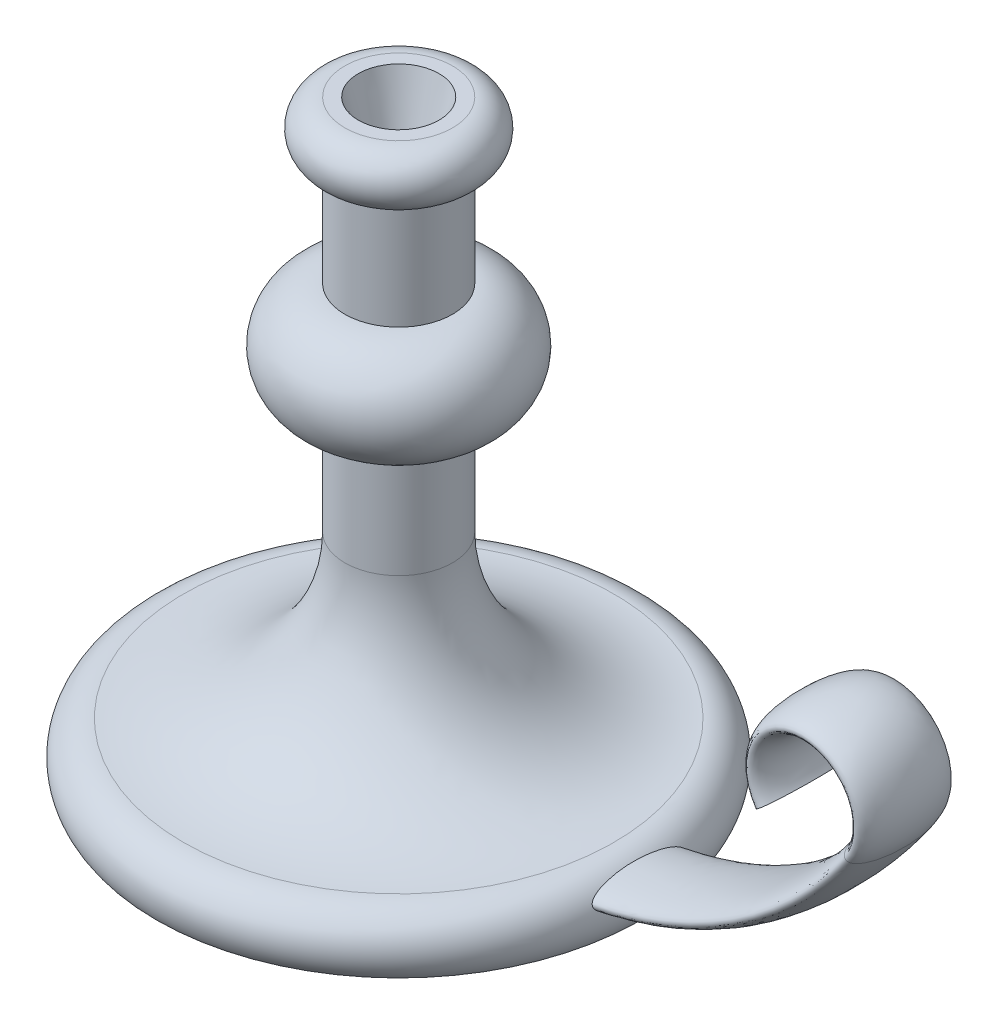
ISO-10303-21;
HEADER;
FILE_DESCRIPTION(('STEP AP214'),'2;1');
FILE_NAME('part.step','',(''),(''),'','','');
FILE_SCHEMA(('AUTOMOTIVE_DESIGN { 1 0 10303 214 1 1 1 1 }'));
ENDSEC;
DATA;
#1=APPLICATION_CONTEXT('core data for automotive mechanical design processes');
#2=APPLICATION_PROTOCOL_DEFINITION('international standard','automotive_design',2000,#1);
#3=PRODUCT_CONTEXT('',#1,'mechanical');
#4=PRODUCT('Part','Part','',(#3));
#5=PRODUCT_RELATED_PRODUCT_CATEGORY('part','',(#4));
#6=PRODUCT_DEFINITION_FORMATION('','',#4);
#7=PRODUCT_DEFINITION_CONTEXT('part definition',#1,'design');
#8=PRODUCT_DEFINITION('design','',#6,#7);
#9=PRODUCT_DEFINITION_SHAPE('','',#8);
#10=(LENGTH_UNIT() NAMED_UNIT(*) SI_UNIT(.MILLI.,.METRE.));
#11=(NAMED_UNIT(*) PLANE_ANGLE_UNIT() SI_UNIT($,.RADIAN.));
#12=(NAMED_UNIT(*) SI_UNIT($,.STERADIAN.) SOLID_ANGLE_UNIT());
#13=UNCERTAINTY_MEASURE_WITH_UNIT(LENGTH_MEASURE(1.E-05),#10,'distance_accuracy_value','');
#14=(GEOMETRIC_REPRESENTATION_CONTEXT(3) GLOBAL_UNCERTAINTY_ASSIGNED_CONTEXT((#13)) GLOBAL_UNIT_ASSIGNED_CONTEXT((#10,
#11,#12)) REPRESENTATION_CONTEXT('',''));
#15=CARTESIAN_POINT('',(0.,0.,0.));
#16=DIRECTION('',(0.,0.,1.));
#17=DIRECTION('',(1.,0.,0.));
#18=AXIS2_PLACEMENT_3D('',#15,#16,#17);
#19=CARTESIAN_POINT('',(0.,7.49999999999996,0.));
#20=DIRECTION('',(0.,1.,0.));
#21=DIRECTION('',(0.,0.,1.));
#22=AXIS2_PLACEMENT_3D('',#19,#20,#21);
#23=TOROIDAL_SURFACE('',#22,80.,12.5);
#24=CARTESIAN_POINT('',(89.5587288046928,12.943491097482,17.5));
#25=CARTESIAN_POINT('',(89.5797065735621,12.9009320695274,17.4999987733392));
#26=CARTESIAN_POINT('',(89.6007942593884,12.8584081451391,17.4977872056109));
#27=CARTESIAN_POINT('',(89.6430046429164,12.7738144298121,17.4890330923458));
#28=CARTESIAN_POINT('',(89.6641273545031,12.7317449545289,17.4824877113559));
#29=CARTESIAN_POINT('',(89.7273891761022,12.6065367151743,17.456601920985));
#30=CARTESIAN_POINT('',(89.7693482038203,12.5245477917591,17.4310129668183));
#31=CARTESIAN_POINT('',(89.8637144328026,12.342406129199,17.3564403958262));
#32=CARTESIAN_POINT('',(89.9155963077435,12.2439372961493,17.302808197235));
#33=CARTESIAN_POINT('',(90.0159284320494,12.0563036104749,17.178822644427));
#34=CARTESIAN_POINT('',(90.0643720741188,11.967156523918,17.1084381694189));
#35=CARTESIAN_POINT('',(90.1521545052276,11.8078120229935,16.965187555981));
#36=CARTESIAN_POINT('',(90.1918880847093,11.7366245636268,16.8936343149704));
#37=CARTESIAN_POINT('',(90.2689098611901,11.600181146011,16.7438070467253));
#38=CARTESIAN_POINT('',(90.3061959913186,11.5349301836299,16.6655274646906));
#39=CARTESIAN_POINT('',(90.3786280228892,11.4095041965593,16.5037832132931));
#40=CARTESIAN_POINT('',(90.413768715644,11.3493413984555,16.4203068469727));
#41=CARTESIAN_POINT('',(90.4820534723874,11.2335846794091,16.2495310652127));
#42=CARTESIAN_POINT('',(90.5151981836459,11.177989275169,16.1622329051619));
#43=CARTESIAN_POINT('',(90.5791654715259,11.0716830058916,15.9861520369719));
#44=CARTESIAN_POINT('',(90.6100182302184,11.0209044561837,15.8974208677003));
#45=CARTESIAN_POINT('',(90.6701968254449,10.9227065253162,15.7176053893381));
#46=CARTESIAN_POINT('',(90.6995224085287,10.875287701269,15.6265206933851));
#47=CARTESIAN_POINT('',(90.7855214499831,10.7373428274865,15.3501307939384));
#48=CARTESIAN_POINT('',(90.8401253695321,10.6512801230355,15.1619478592305));
#49=CARTESIAN_POINT('',(90.9447652113285,10.4886463615558,14.7801779899081));
#50=CARTESIAN_POINT('',(90.9947973531384,10.412083141336,14.5865867527752));
#51=CARTESIAN_POINT('',(91.0911603902348,10.2664746734292,14.194493600218));
#52=CARTESIAN_POINT('',(91.1374704730976,10.1974710090505,13.9959712383188));
#53=CARTESIAN_POINT('',(91.2265375494096,10.0662767573037,13.5961727542854));
#54=CARTESIAN_POINT('',(91.2692983715127,10.004078804806,13.3948998795926));
#55=CARTESIAN_POINT('',(91.3516785885702,9.88549866787864,12.990093290007));
#56=CARTESIAN_POINT('',(91.391298947693,9.82911469685862,12.7865602910559));
#57=CARTESIAN_POINT('',(91.4750164110327,9.71110380636633,12.3384569790105));
#58=CARTESIAN_POINT('',(91.5185168379836,9.65054212738435,12.0934955061601));
#59=CARTESIAN_POINT('',(91.6018522463878,9.53568521283294,11.6014768603504));
#60=CARTESIAN_POINT('',(91.6416868895698,9.48139055545465,11.3544194962791));
#61=CARTESIAN_POINT('',(91.7180115493886,9.37829705951905,10.8583423567117));
#62=CARTESIAN_POINT('',(91.7544975822119,9.3295047516787,10.6093206169256));
#63=CARTESIAN_POINT('',(91.8242908347455,9.23692825647491,10.1099003702325));
#64=CARTESIAN_POINT('',(91.8575979045755,9.19314430522385,9.8595017989994));
#65=CARTESIAN_POINT('',(91.9530949263991,9.06851029293003,9.10601073634845));
#66=CARTESIAN_POINT('',(92.0107726053222,8.99449596784669,8.6012022750369));
#67=CARTESIAN_POINT('',(92.1151219132564,8.86202399348692,7.58834905945466));
#68=CARTESIAN_POINT('',(92.1617909726024,8.80356997593603,7.08030357795545));
#69=CARTESIAN_POINT('',(92.2447483256083,8.70051647101428,6.0622143882432));
#70=CARTESIAN_POINT('',(92.2810413967241,8.65591060666995,5.55217170962232));
#71=CARTESIAN_POINT('',(92.3436884848462,8.57936604703266,4.53103877111516));
#72=CARTESIAN_POINT('',(92.3700520870433,8.54741513401911,4.01995000283738));
#73=CARTESIAN_POINT('',(92.4131662522144,8.49535652655205,2.99702328646712));
#74=CARTESIAN_POINT('',(92.4299215453173,8.47524300447369,2.48518583158811));
#75=CARTESIAN_POINT('',(92.4540064539887,8.44637745948381,1.4610441021442));
#76=CARTESIAN_POINT('',(92.4613373612892,8.43762387954617,0.948739901187229));
#77=CARTESIAN_POINT('',(92.4668835645219,8.43099761842062,-0.121137356464432));
#78=CARTESIAN_POINT('',(92.4642387260214,8.43415166465893,-0.678721647746041));
#79=CARTESIAN_POINT('',(92.4478492874817,8.45375380315143,-1.79354622633581));
#80=CARTESIAN_POINT('',(92.4341036636857,8.47020312154647,-2.35078647717152));
#81=CARTESIAN_POINT('',(92.395376185897,8.51680502145714,-3.46356270379382));
#82=CARTESIAN_POINT('',(92.3704093501636,8.54693928785559,-4.01909996153308));
#83=CARTESIAN_POINT('',(92.3089356344802,8.62174234985879,-5.12853157199538));
#84=CARTESIAN_POINT('',(92.2724296237258,8.66641005073089,-5.68242604529122));
#85=CARTESIAN_POINT('',(92.195280478982,8.76186104665923,-6.68494132573201));
#86=CARTESIAN_POINT('',(92.1566709269117,8.80996008678012,-7.13397415789138));
#87=CARTESIAN_POINT('',(92.071057952897,8.91778907554138,-8.0298241395656));
#88=CARTESIAN_POINT('',(92.0240550167584,8.97751835104636,-8.47664141577845));
#89=CARTESIAN_POINT('',(91.9210655130053,9.11014408151181,-9.36737950787144));
#90=CARTESIAN_POINT('',(91.8650777798835,9.18304224489412,-9.81129994018783));
#91=CARTESIAN_POINT('',(91.7737263929386,9.30392646449852,-10.4740036507115));
#92=CARTESIAN_POINT('',(91.742050339853,9.34614036011506,-10.6943586493466));
#93=CARTESIAN_POINT('',(91.6760909533605,9.43479944885849,-11.1338218950942));
#94=CARTESIAN_POINT('',(91.6418077107162,9.48124449469977,-11.3529301853225));
#95=CARTESIAN_POINT('',(91.5702879815948,9.5790513956825,-11.79067508291));
#96=CARTESIAN_POINT('',(91.5330383723577,9.63043533356874,-12.0093046334202));
#97=CARTESIAN_POINT('',(91.4554935112394,9.73852531214286,-12.4447361177186));
#98=CARTESIAN_POINT('',(91.4151979027315,9.79523197620597,-12.6615378341901));
#99=CARTESIAN_POINT('',(91.3312470558202,9.91474138844755,-13.0929505011101));
#100=CARTESIAN_POINT('',(91.2875898608404,9.97754769249938,-13.3075600920878));
#101=CARTESIAN_POINT('',(91.1963851345974,10.1104433349743,-13.7345945259261));
#102=CARTESIAN_POINT('',(91.1488239437887,10.1805584989223,-13.9470084917581));
#103=CARTESIAN_POINT('',(91.0494535270498,10.3291604976874,-14.3677863161023));
#104=CARTESIAN_POINT('',(90.9976462336352,10.4076435289027,-14.5761519642817));
#105=CARTESIAN_POINT('',(90.8891011180458,10.5747321782097,-14.9872975361315));
#106=CARTESIAN_POINT('',(90.8323684533084,10.6633272377135,-15.1900830166363));
#107=CARTESIAN_POINT('',(90.7423884488406,10.8064216145953,-15.489675684287));
#108=CARTESIAN_POINT('',(90.7113604172316,10.8561828231518,-15.5894180061674));
#109=CARTESIAN_POINT('',(90.6475772060112,10.9594637996732,-15.7864280727459));
#110=CARTESIAN_POINT('',(90.6148215268706,11.0129846561974,-15.8836950895529));
#111=CARTESIAN_POINT('',(90.54733954141,11.1243874296635,-16.0752032497676));
#112=CARTESIAN_POINT('',(90.5126106477947,11.1822751065795,-16.1694401543013));
#113=CARTESIAN_POINT('',(90.4412986583412,11.3024669128547,-16.3529941675704));
#114=CARTESIAN_POINT('',(90.4047355738429,11.3647254821605,-16.4423485791115));
#115=CARTESIAN_POINT('',(90.3292239594874,11.4948356566658,-16.6156983457681));
#116=CARTESIAN_POINT('',(90.2902780254188,11.5626812025482,-16.6996993359205));
#117=CARTESIAN_POINT('',(90.2097355638264,11.7047932327581,-16.8604598746779));
#118=CARTESIAN_POINT('',(90.168145299969,11.7790446821642,-16.9372355403949));
#119=CARTESIAN_POINT('',(90.1024392119482,11.8979753637164,-17.0468962032739));
#120=CARTESIAN_POINT('',(90.0793916224274,11.9399766930439,-17.0833267960588));
#121=CARTESIAN_POINT('',(90.0324633104608,12.0261293384028,-17.1529584043934));
#122=CARTESIAN_POINT('',(90.0085825209875,12.070280827519,-17.1861591592987));
#123=CARTESIAN_POINT('',(89.9357529711721,12.2059636157102,-17.2799257757075));
#124=CARTESIAN_POINT('',(89.8855098043284,12.3009165691227,-17.3348406097792));
#125=CARTESIAN_POINT('',(89.7945232937669,12.4757034576329,-17.4130230947387));
#126=CARTESIAN_POINT('',(89.7543351482949,12.5538194612115,-17.4407004655116));
#127=CARTESIAN_POINT('',(89.6935213724101,12.6735001861615,-17.4709942576742));
#128=CARTESIAN_POINT('',(89.6731607022411,12.7138131973763,-17.4792219148679));
#129=CARTESIAN_POINT('',(89.6323944804243,12.7950187080501,-17.4917165394133));
#130=CARTESIAN_POINT('',(89.611988948646,12.8359109827517,-17.4959850024114));
#131=CARTESIAN_POINT('',(89.5711999274895,12.9181386441871,-17.5004290289568));
#132=CARTESIAN_POINT('',(89.550816872553,12.9594751608777,-17.5005877169693));
#133=CARTESIAN_POINT('',(89.5103170766654,13.0420838141631,-17.4967512287595));
#134=CARTESIAN_POINT('',(89.4902003291188,13.08335595233,-17.4927561556072));
#135=CARTESIAN_POINT('',(89.4503727954529,13.1655201453038,-17.4807156912096));
#136=CARTESIAN_POINT('',(89.4306621699401,13.2064120463615,-17.4726687284178));
#137=CARTESIAN_POINT('',(89.3917687407356,13.2875238714445,-17.4527365655014));
#138=CARTESIAN_POINT('',(89.3725862147789,13.3277434376714,-17.4408493860744));
#139=CARTESIAN_POINT('',(89.3308446587077,13.4156920573506,-17.4106316431778));
#140=CARTESIAN_POINT('',(89.3084319809595,13.4632054301083,-17.3914693303032));
#141=CARTESIAN_POINT('',(89.2646135091604,13.5566012541563,-17.3485353293614));
#142=CARTESIAN_POINT('',(89.2432084432814,13.6024825202932,-17.3247603695361));
#143=CARTESIAN_POINT('',(89.1804654446562,13.7376267648072,-17.2473339021488));
#144=CARTESIAN_POINT('',(89.1406922060577,13.8241945706948,-17.1876523793818));
#145=CARTESIAN_POINT('',(89.0716042639233,13.9757019367862,-17.0679404694284));
#146=CARTESIAN_POINT('',(89.041660855699,14.0418169994439,-17.0096928349968));
#147=CARTESIAN_POINT('',(88.9842556796732,14.1692106717563,-16.8872316113715));
#148=CARTESIAN_POINT('',(88.956790429588,14.2304960521946,-16.8230266592164));
#149=CARTESIAN_POINT('',(88.9039142156295,14.3489505181685,-16.6898011495197));
#150=CARTESIAN_POINT('',(88.8785096792512,14.406106667992,-16.6207666881769));
#151=CARTESIAN_POINT('',(88.829550370339,14.5165886598171,-16.4790587478513));
#152=CARTESIAN_POINT('',(88.8059962308666,14.5699131904097,-16.4063840372646));
#153=CARTESIAN_POINT('',(88.7408961977662,14.7176039575285,-16.1943843376352));
#154=CARTESIAN_POINT('',(88.7013169669705,14.8077846430657,-16.0515393783182));
#155=CARTESIAN_POINT('',(88.6263973519262,14.9787160620163,-15.7590828742829));
#156=CARTESIAN_POINT('',(88.5910633688108,15.059452550419,-15.6094615682929));
#157=CARTESIAN_POINT('',(88.523775561528,15.2131105434892,-15.3054088417595));
#158=CARTESIAN_POINT('',(88.4918242431009,15.2860262553611,-15.1509739636218));
#159=CARTESIAN_POINT('',(88.4305248040312,15.4256089660389,-14.8378106630639));
#160=CARTESIAN_POINT('',(88.401191441125,15.4922406474402,-14.6790637658814));
#161=CARTESIAN_POINT('',(88.3448688199119,15.6197268218576,-14.3590628921533));
#162=CARTESIAN_POINT('',(88.3178772246645,15.6805870801782,-14.1978116088513));
#163=CARTESIAN_POINT('',(88.2658583677597,15.7973372605739,-13.8732733258429));
#164=CARTESIAN_POINT('',(88.2408305225381,15.8532286598978,-13.7099869477449));
#165=CARTESIAN_POINT('',(88.1862167579687,15.9745198910423,-13.339382677414));
#166=CARTESIAN_POINT('',(88.1571216860903,16.0386505142622,-13.1315778715507));
#167=CARTESIAN_POINT('',(88.1011978176443,16.1609388922341,-12.7139048838633));
#168=CARTESIAN_POINT('',(88.0743692673692,16.2190959980194,-12.504036480557));
#169=CARTESIAN_POINT('',(88.0226627488167,16.3302043389401,-12.0824153066));
#170=CARTESIAN_POINT('',(87.9977871982408,16.3831491414983,-11.8706605507101));
#171=CARTESIAN_POINT('',(87.9498122896424,16.4843107327253,-11.4458206958401));
#172=CARTESIAN_POINT('',(87.9267130218262,16.5325272813094,-11.23273552989));
#173=CARTESIAN_POINT('',(87.8597773817534,16.6709012844059,-10.591291571125));
#174=CARTESIAN_POINT('',(87.8183686116727,16.7546430530998,-10.1612864891615));
#175=CARTESIAN_POINT('',(87.7412172003251,16.90774595559,-9.29816441577837));
#176=CARTESIAN_POINT('',(87.7054758822596,16.9771037322621,-8.86504672224677));
#177=CARTESIAN_POINT('',(87.6392276205439,17.1033646272564,-7.99592344318985));
#178=CARTESIAN_POINT('',(87.6087288731255,17.1602482811406,-7.55991442284061));
#179=CARTESIAN_POINT('',(87.5528920715488,17.2627086904934,-6.68673095588642));
#180=CARTESIAN_POINT('',(87.5275484964604,17.3082975536467,-6.24955826945803));
#181=CARTESIAN_POINT('',(87.481954525883,17.3891925106307,-5.37423038456118));
#182=CARTESIAN_POINT('',(87.4617015124772,17.4245038913318,-4.9360758085025));
#183=CARTESIAN_POINT('',(87.4263029858446,17.4855595073432,-4.05894731093772));
#184=CARTESIAN_POINT('',(87.4111569687685,17.5113046864678,-3.61997347455811));
#185=CARTESIAN_POINT('',(87.3791322232449,17.5653616618722,-2.50041935226446));
#186=CARTESIAN_POINT('',(87.3658619674695,17.587332040673,-1.81941888823011));
#187=CARTESIAN_POINT('',(87.3518729068078,17.6104816392424,-0.456679823492289));
#188=CARTESIAN_POINT('',(87.3511591288809,17.6116525319826,0.225058963571186));
#189=CARTESIAN_POINT('',(87.3623091776521,17.5932185317596,1.58840921963174));
#190=CARTESIAN_POINT('',(87.374177712641,17.5736058616057,2.27002054544179));
#191=CARTESIAN_POINT('',(87.4102771848005,17.5128712827361,3.62977168807806));
#192=CARTESIAN_POINT('',(87.4344678612294,17.4718194124095,4.30791559105161));
#193=CARTESIAN_POINT('',(87.479854988707,17.3927566634633,5.32323119748966));
#194=CARTESIAN_POINT('',(87.4964980795468,17.3634932844761,5.66130841994979));
#195=CARTESIAN_POINT('',(87.532811894298,17.2987754545393,6.33670368229191));
#196=CARTESIAN_POINT('',(87.5524825283173,17.263321187402,6.67402174441289));
#197=CARTESIAN_POINT('',(87.59486060612,17.1857954407875,7.34754345466152));
#198=CARTESIAN_POINT('',(87.6175665970513,17.1437271253919,7.68374755756786));
#199=CARTESIAN_POINT('',(87.6660846710805,17.0523887749657,8.35494150911656));
#200=CARTESIAN_POINT('',(87.6918965920618,17.0031191157864,8.6899314201953));
#201=CARTESIAN_POINT('',(87.740008066456,16.9097388346656,9.27610966741508));
#202=CARTESIAN_POINT('',(87.7616082874714,16.8673434766163,9.52762911751679));
#203=CARTESIAN_POINT('',(87.8067452395517,16.7776330395124,10.0296163363318));
#204=CARTESIAN_POINT('',(87.8302819478051,16.730318018409,10.280084117397));
#205=CARTESIAN_POINT('',(87.8794147584665,16.630305607243,10.7795763730646));
#206=CARTESIAN_POINT('',(87.9050095422028,16.5776116578821,11.0286016639611));
#207=CARTESIAN_POINT('',(87.9584700655039,16.4661997987341,11.5250591714857));
#208=CARTESIAN_POINT('',(87.9863357430504,16.4074820534465,11.7724914314207));
#209=CARTESIAN_POINT('',(88.0359905704158,16.3016363192813,12.1923244954659));
#210=CARTESIAN_POINT('',(88.0571340178452,16.2562287703239,12.3652358650849));
#211=CARTESIAN_POINT('',(88.1008245048912,16.1616904705926,12.7098573337215));
#212=CARTESIAN_POINT('',(88.1233714958218,16.1125598489512,12.8815674741774));
#213=CARTESIAN_POINT('',(88.1700823744461,16.0100698666647,13.2238203379258));
#214=CARTESIAN_POINT('',(88.194248882766,15.9567036251034,13.3943606515968));
#215=CARTESIAN_POINT('',(88.2443949387773,15.8452877534177,13.7336489571485));
#216=CARTESIAN_POINT('',(88.2703745489958,15.7872379617642,13.9023968869851));
#217=CARTESIAN_POINT('',(88.3262093157212,15.661838918429,14.2485596526478));
#218=CARTESIAN_POINT('',(88.3562067150126,15.5941301227018,14.4258222840916));
#219=CARTESIAN_POINT('',(88.4190888282311,15.4516224859641,14.7769796944045));
#220=CARTESIAN_POINT('',(88.4519735574094,15.3768236075029,14.9508744554784));
#221=CARTESIAN_POINT('',(88.5211982887109,15.2190185944214,15.2935151448006));
#222=CARTESIAN_POINT('',(88.557526468531,15.1360405047009,15.462276237744));
#223=CARTESIAN_POINT('',(88.6346995903192,14.9597814383619,15.7934229224851));
#224=CARTESIAN_POINT('',(88.6755459075596,14.8664973247116,15.955806552558));
#225=CARTESIAN_POINT('',(88.7545331250642,14.686656131017,16.2399500314024));
#226=CARTESIAN_POINT('',(88.7916265156419,14.6023834849248,16.3634190551954));
#227=CARTESIAN_POINT('',(88.8508584910335,14.4684705187302,16.541688164037));
#228=CARTESIAN_POINT('',(88.8711900103184,14.422607133011,16.599927927079));
#229=CARTESIAN_POINT('',(88.9132101720195,14.3281113371031,16.7135920748556));
#230=CARTESIAN_POINT('',(88.9348984924227,14.2794795841828,16.7690171219986));
#231=CARTESIAN_POINT('',(88.9801627953803,14.1783722774196,16.8772546814343));
#232=CARTESIAN_POINT('',(89.00376301894,14.1258484578802,16.9300126929631));
#233=CARTESIAN_POINT('',(89.0527120162175,14.0174284151855,17.0310329608707));
#234=CARTESIAN_POINT('',(89.0780611930733,13.9615314148782,17.0792941746602));
#235=CARTESIAN_POINT('',(89.1568581269603,13.7887656097781,17.2153212599501));
#236=CARTESIAN_POINT('',(89.213288807223,13.6662967419068,17.2949214465554));
#237=CARTESIAN_POINT('',(89.3097586215113,13.4602452341837,17.3942410165622));
#238=CARTESIAN_POINT('',(89.3472274289581,13.3809046659833,17.4251629094807));
#239=CARTESIAN_POINT('',(89.4051332200136,13.2595892759897,17.4602013848838));
#240=CARTESIAN_POINT('',(89.4246996819537,13.2188062245319,17.4699862549181));
#241=CARTESIAN_POINT('',(89.4643007149188,13.1367191282722,17.4855548008217));
#242=CARTESIAN_POINT('',(89.4843349905535,13.0954154194254,17.4913409345561));
#243=CARTESIAN_POINT('',(89.5135066045012,13.03561884691,17.4966974351351));
#244=CARTESIAN_POINT('',(89.5225151592649,13.0171997637652,17.4979351766907));
#245=CARTESIAN_POINT('',(89.5405852068109,12.9803486270547,17.4995867637212));
#246=CARTESIAN_POINT('',(89.5496467045314,12.961916572425,17.5000005310696));
#247=CARTESIAN_POINT('',(89.5587288046928,12.943491097482,17.5));
#248=B_SPLINE_CURVE_WITH_KNOTS('',3,(#24,#25,#26,#27,#28,#29,#30,#31,#32,#33,#34,#35,#36,#37,
#38,#39,#40,#41,#42,#43,#44,#45,#46,#47,#48,#49,#50,#51,#52,#53,#54,#55,#56,#57,#58,#59,#60,#61,
#62,#63,#64,#65,#66,#67,#68,#69,#70,#71,#72,#73,#74,#75,#76,#77,#78,#79,#80,#81,#82,#83,#84,#85,
#86,#87,#88,#89,#90,#91,#92,#93,#94,#95,#96,#97,#98,#99,#100,#101,#102,#103,#104,#105,#106,#107,
#108,#109,#110,#111,#112,#113,#114,#115,#116,#117,#118,#119,#120,#121,#122,#123,#124,#125,#126,
#127,#128,#129,#130,#131,#132,#133,#134,#135,#136,#137,#138,#139,#140,#141,#142,#143,#144,#145,
#146,#147,#148,#149,#150,#151,#152,#153,#154,#155,#156,#157,#158,#159,#160,#161,#162,#163,#164,
#165,#166,#167,#168,#169,#170,#171,#172,#173,#174,#175,#176,#177,#178,#179,#180,#181,#182,#183,
#184,#185,#186,#187,#188,#189,#190,#191,#192,#193,#194,#195,#196,#197,#198,#199,#200,#201,#202,
#203,#204,#205,#206,#207,#208,#209,#210,#211,#212,#213,#214,#215,#216,#217,#218,#219,#220,#221,
#222,#223,#224,#225,#226,#227,#228,#229,#230,#231,#232,#233,#234,#235,#236,#237,#238,#239,#240,
#241,#242,#243,#244,#245,#246,#247),.UNSPECIFIED.,.T.,.F.,(4,2,2,2,2,2,2,2,2,2,2,2,2,2,2,2,2,2,
2,2,2,2,2,2,2,2,2,2,2,2,2,2,2,2,2,2,2,2,2,2,2,2,2,2,2,2,2,2,2,2,2,2,2,2,2,2,2,2,2,2,2,2,2,2,2,2,
2,2,2,2,2,2,2,2,2,2,2,2,2,2,2,2,2,2,2,2,2,2,2,2,2,2,2,2,2,2,2,2,2,2,2,2,2,2,2,2,2,2,2,2,2,4),
(0.,0.142320602367623,0.284734411951068,0.57005520820097,0.938661218594988,1.30795740973198,
1.63290830462805,1.95813018070209,2.28411256850311,2.60998866895351,2.93024675903878,
3.2505578308925,3.89211706766325,4.53420210256642,5.17965836774264,5.82440906479098,
6.46896104090198,7.2370053256913,8.00512041318109,8.77413778583726,9.54319139787614,
11.083090329169,12.6233483534049,14.1628960443861,15.7009537349412,17.2382535948807,
18.7753427258455,20.4478714784685,22.1205544956907,23.7910054612309,25.4613306289756,
26.8208702065561,28.180331120011,29.5399685254269,30.2196831597806,30.8993741424203,
31.5822596290076,32.2652251922869,32.9485913178249,33.634459659782,34.3200175597803,
35.0048660648135,35.3518995701918,35.6990339722813,36.046634543178,36.3910353450337,
36.7350674281998,37.0783129462233,37.2587540657116,37.4392097345455,37.7992641545481,
38.074375804055,38.2119425483448,38.3494573034956,38.4875366318219,38.6256125339724,
38.7637420308796,38.9019428355888,39.0694431347825,39.2370626794632,39.5729769274083,
39.8518077312025,40.1302404156385,40.4095105872743,40.6888758909983,41.2087299643988,
41.7293583079735,42.2503696524275,42.7741535605613,43.297408603338,43.8205075577504,
44.478620931376,45.1368057273964,45.7957928754912,46.4548134674074,47.774544478808,
49.0945831605134,50.4166671817783,51.7373277752949,53.0573077982569,54.377157555635,
56.4211356861914,58.4659321004463,60.5114939459638,62.5504146921701,63.5696054047264,
64.5887658618398,65.6074402400255,66.6260614707045,67.393953299219,68.1618360833672,
68.9292307231565,69.6966044123106,70.2366238882522,70.7766246425306,71.3175213456499,
71.8584367115198,72.4346170197102,73.0108003715189,73.5850726252757,74.1595201648484,
74.621004620508,74.8515152278988,75.0819713336703,75.3160361845632,75.5501551694077,
76.0159453177268,76.2938417360335,76.4325288871446,76.5711307167438,76.6327410545283,
76.6943572337227),.UNSPECIFIED.);
#249=CARTESIAN_POINT('',(89.5587288046928,12.943491097482,17.5));
#250=VERTEX_POINT('',#249);
#251=EDGE_CURVE('E11',#250,#250,#248,.T.);
#252=ORIENTED_EDGE('',*,*,#251,.F.);
#253=EDGE_LOOP('',(#252));
#254=FACE_BOUND('',#253,.T.);
#255=CARTESIAN_POINT('',(0.,0.,0.));
#256=DIRECTION('',(0.,1.,0.));
#257=DIRECTION('',(0.,0.,1.));
#258=AXIS2_PLACEMENT_3D('',#255,#256,#257);
#259=CIRCLE('',#258,90.);
#260=CARTESIAN_POINT('',(0.,0.,90.));
#261=VERTEX_POINT('',#260);
#262=EDGE_CURVE('E79',#261,#261,#259,.T.);
#263=ORIENTED_EDGE('',*,*,#262,.T.);
#264=EDGE_LOOP('',(#263));
#265=FACE_BOUND('',#264,.T.);
#266=CARTESIAN_POINT('',(0.,20.,0.));
#267=DIRECTION('',(0.,1.,0.));
#268=DIRECTION('',(0.,0.,1.));
#269=AXIS2_PLACEMENT_3D('',#266,#267,#268);
#270=CIRCLE('',#269,79.9999999999999);
#271=CARTESIAN_POINT('',(0.,20.,79.9999999999999));
#272=VERTEX_POINT('',#271);
#273=EDGE_CURVE('E57',#272,#272,#270,.T.);
#274=ORIENTED_EDGE('',*,*,#273,.F.);
#275=EDGE_LOOP('',(#274));
#276=FACE_BOUND('',#275,.T.);
#277=ADVANCED_FACE('F47',(#254,#265,#276),#23,.T.);
#278=CARTESIAN_POINT('',(0.,80.,0.));
#279=DIRECTION('',(0.,1.,0.));
#280=DIRECTION('',(0.,0.,1.));
#281=AXIS2_PLACEMENT_3D('',#278,#279,#280);
#282=TOROIDAL_SURFACE('',#281,80.,60.);
#283=ORIENTED_EDGE('',*,*,#273,.T.);
#284=EDGE_LOOP('',(#283));
#285=FACE_BOUND('',#284,.T.);
#286=CARTESIAN_POINT('',(0.,79.9999999999999,0.));
#287=DIRECTION('',(0.,1.,0.));
#288=DIRECTION('',(0.,0.,1.));
#289=AXIS2_PLACEMENT_3D('',#286,#287,#288);
#290=CIRCLE('',#289,20.);
#291=CARTESIAN_POINT('',(0.,79.9999999999999,20.));
#292=VERTEX_POINT('',#291);
#293=EDGE_CURVE('E61',#292,#292,#290,.T.);
#294=ORIENTED_EDGE('',*,*,#293,.F.);
#295=EDGE_LOOP('',(#294));
#296=FACE_BOUND('',#295,.T.);
#297=ADVANCED_FACE('F127',(#285,#296),#282,.F.);
#298=CARTESIAN_POINT('',(0.,220.,0.));
#299=DIRECTION('',(0.,1.,0.));
#300=DIRECTION('',(0.,0.,1.));
#301=AXIS2_PLACEMENT_3D('',#298,#299,#300);
#302=CYLINDRICAL_SURFACE('',#301,20.);
#303=ORIENTED_EDGE('',*,*,#293,.T.);
#304=EDGE_LOOP('',(#303));
#305=FACE_BOUND('',#304,.T.);
#306=CARTESIAN_POINT('',(0.,120.,0.));
#307=DIRECTION('',(0.,1.,0.));
#308=DIRECTION('',(0.,0.,1.));
#309=AXIS2_PLACEMENT_3D('',#306,#307,#308);
#310=CIRCLE('',#309,20.);
#311=CARTESIAN_POINT('',(0.,120.,20.));
#312=VERTEX_POINT('',#311);
#313=EDGE_CURVE('E65',#312,#312,#310,.T.);
#314=ORIENTED_EDGE('',*,*,#313,.F.);
#315=EDGE_LOOP('',(#314));
#316=FACE_BOUND('',#315,.T.);
#317=ADVANCED_FACE('F132',(#305,#316),#302,.T.);
#318=CARTESIAN_POINT('',(0.,140.,0.));
#319=DIRECTION('',(0.,1.,0.));
#320=DIRECTION('',(0.,0.,1.));
#321=AXIS2_PLACEMENT_3D('',#318,#319,#320);
#322=DEGENERATE_TOROIDAL_SURFACE('',#321,20.,20.,.T.);
#323=ORIENTED_EDGE('',*,*,#313,.T.);
#324=EDGE_LOOP('',(#323));
#325=FACE_BOUND('',#324,.T.);
#326=CARTESIAN_POINT('',(0.,160.,0.));
#327=DIRECTION('',(0.,1.,0.));
#328=DIRECTION('',(0.,0.,1.));
#329=AXIS2_PLACEMENT_3D('',#326,#327,#328);
#330=CIRCLE('',#329,20.);
#331=CARTESIAN_POINT('',(0.,160.,20.));
#332=VERTEX_POINT('',#331);
#333=EDGE_CURVE('E70',#332,#332,#330,.T.);
#334=ORIENTED_EDGE('',*,*,#333,.F.);
#335=EDGE_LOOP('',(#334));
#336=FACE_BOUND('',#335,.T.);
#337=ADVANCED_FACE('F123',(#325,#336),#322,.T.);
#338=CARTESIAN_POINT('',(0.,220.,0.));
#339=DIRECTION('',(0.,1.,0.));
#340=DIRECTION('',(0.,0.,1.));
#341=AXIS2_PLACEMENT_3D('',#338,#339,#340);
#342=CYLINDRICAL_SURFACE('',#341,20.);
#343=ORIENTED_EDGE('',*,*,#333,.T.);
#344=EDGE_LOOP('',(#343));
#345=FACE_BOUND('',#344,.T.);
#346=CARTESIAN_POINT('',(0.,200.,0.));
#347=DIRECTION('',(0.,1.,0.));
#348=DIRECTION('',(0.,0.,1.));
#349=AXIS2_PLACEMENT_3D('',#346,#347,#348);
#350=CIRCLE('',#349,20.);
#351=CARTESIAN_POINT('',(0.,200.,20.));
#352=VERTEX_POINT('',#351);
#353=EDGE_CURVE('E73',#352,#352,#350,.T.);
#354=ORIENTED_EDGE('',*,*,#353,.F.);
#355=EDGE_LOOP('',(#354));
#356=FACE_BOUND('',#355,.T.);
#357=ADVANCED_FACE('F116',(#345,#356),#342,.T.);
#358=CARTESIAN_POINT('',(0.,210.,0.));
#359=DIRECTION('',(0.,1.,0.));
#360=DIRECTION('',(0.,0.,1.));
#361=AXIS2_PLACEMENT_3D('',#358,#359,#360);
#362=TOROIDAL_SURFACE('',#361,20.,10.);
#363=ORIENTED_EDGE('',*,*,#353,.T.);
#364=EDGE_LOOP('',(#363));
#365=FACE_BOUND('',#364,.T.);
#366=CARTESIAN_POINT('',(0.,220.,0.));
#367=DIRECTION('',(0.,1.,0.));
#368=DIRECTION('',(0.,0.,1.));
#369=AXIS2_PLACEMENT_3D('',#366,#367,#368);
#370=CIRCLE('',#369,20.);
#371=CARTESIAN_POINT('',(0.,220.,20.));
#372=VERTEX_POINT('',#371);
#373=EDGE_CURVE('E76',#372,#372,#370,.T.);
#374=ORIENTED_EDGE('',*,*,#373,.F.);
#375=EDGE_LOOP('',(#374));
#376=FACE_BOUND('',#375,.T.);
#377=ADVANCED_FACE('F111',(#365,#376),#362,.T.);
#378=CARTESIAN_POINT('',(0.,220.,0.));
#379=DIRECTION('',(0.,1.,0.));
#380=DIRECTION('',(0.,0.,1.));
#381=AXIS2_PLACEMENT_3D('',#378,#379,#380);
#382=PLANE('',#381);
#383=CARTESIAN_POINT('',(0.,220.,0.));
#384=DIRECTION('',(0.,1.,0.));
#385=DIRECTION('',(0.,0.,1.));
#386=AXIS2_PLACEMENT_3D('',#383,#384,#385);
#387=CIRCLE('',#386,15.);
#388=CARTESIAN_POINT('',(0.,220.,15.));
#389=VERTEX_POINT('',#388);
#390=EDGE_CURVE('E101',#389,#389,#387,.T.);
#391=ORIENTED_EDGE('',*,*,#390,.F.);
#392=EDGE_LOOP('',(#391));
#393=FACE_BOUND('',#392,.T.);
#394=ORIENTED_EDGE('',*,*,#373,.T.);
#395=EDGE_LOOP('',(#394));
#396=FACE_BOUND('',#395,.T.);
#397=ADVANCED_FACE('F107',(#393,#396),#382,.T.);
#398=CARTESIAN_POINT('',(0.,0.,0.));
#399=DIRECTION('',(0.,1.,0.));
#400=DIRECTION('',(0.,0.,1.));
#401=AXIS2_PLACEMENT_3D('',#398,#399,#400);
#402=PLANE('',#401);
#403=ORIENTED_EDGE('',*,*,#262,.F.);
#404=EDGE_LOOP('',(#403));
#405=FACE_BOUND('',#404,.T.);
#406=ADVANCED_FACE('F110',(#405),#402,.F.);
#407=CARTESIAN_POINT('',(60.,10.,17.5));
#408=CARTESIAN_POINT('',(68.8449287315368,10.,17.5));
#409=CARTESIAN_POINT('',(86.8217653535738,11.596369643285,17.5));
#410=CARTESIAN_POINT('',(113.122814904631,18.8295318557064,17.5));
#411=CARTESIAN_POINT('',(139.40961497383,31.5645009431901,17.5));
#412=CARTESIAN_POINT('',(163.779132553345,50.1291478103678,17.5));
#413=CARTESIAN_POINT('',(177.671134860864,66.390814678553,17.5));
#414=CARTESIAN_POINT('',(183.592070943083,75.,17.5));
#415=CARTESIAN_POINT('',(60.,0.,17.5));
#416=CARTESIAN_POINT('',(68.8449287315368,0.,17.5));
#417=CARTESIAN_POINT('',(88.8791008211384,1.70510878666408,17.5));
#418=CARTESIAN_POINT('',(116.561041144261,9.39636342056773,17.5));
#419=CARTESIAN_POINT('',(144.752158398724,23.0530641853677,17.5));
#420=CARTESIAN_POINT('',(170.476122288631,42.508723552482,17.5));
#421=CARTESIAN_POINT('',(185.885830330713,60.6881232113223,17.5));
#422=CARTESIAN_POINT('',(191.806766412932,69.2973085327693,17.5));
#423=CARTESIAN_POINT('',(60.,0.,-17.5));
#424=CARTESIAN_POINT('',(68.8449287315368,0.,-17.5));
#425=CARTESIAN_POINT('',(88.8791008211384,1.70510878666408,-17.5));
#426=CARTESIAN_POINT('',(116.561041144261,9.39636342056773,-17.5));
#427=CARTESIAN_POINT('',(144.752158398724,23.0530641853677,-17.5));
#428=CARTESIAN_POINT('',(170.476122288631,42.508723552482,-17.5));
#429=CARTESIAN_POINT('',(185.885830330713,60.6881232113223,-17.5));
#430=CARTESIAN_POINT('',(191.806766412932,69.2973085327693,-17.5));
#431=CARTESIAN_POINT('',(60.,10.,-17.5));
#432=CARTESIAN_POINT('',(68.8449287315368,10.,-17.5));
#433=CARTESIAN_POINT('',(86.8217653535738,11.596369643285,-17.5));
#434=CARTESIAN_POINT('',(113.122814904631,18.8295318557064,-17.5));
#435=CARTESIAN_POINT('',(139.40961497383,31.5645009431901,-17.5));
#436=CARTESIAN_POINT('',(163.779132553345,50.1291478103678,-17.5));
#437=CARTESIAN_POINT('',(177.671134860864,66.390814678553,-17.5));
#438=CARTESIAN_POINT('',(183.592070943083,75.,-17.5));
#439=CARTESIAN_POINT('',(60.,20.,-17.5));
#440=CARTESIAN_POINT('',(68.8449287315368,20.,-17.5));
#441=CARTESIAN_POINT('',(84.7644298860093,21.4876304999059,-17.5));
#442=CARTESIAN_POINT('',(109.684588665001,28.262700290845,-17.5));
#443=CARTESIAN_POINT('',(134.067071548937,40.0759377010125,-17.5));
#444=CARTESIAN_POINT('',(157.082142818059,57.7495720682536,-17.5));
#445=CARTESIAN_POINT('',(169.456439391015,72.0935061457837,-17.5));
#446=CARTESIAN_POINT('',(175.377375473234,80.7026914672307,-17.5));
#447=CARTESIAN_POINT('',(60.,20.,17.5));
#448=CARTESIAN_POINT('',(68.8449287315368,20.,17.5));
#449=CARTESIAN_POINT('',(84.7644298860093,21.4876304999059,17.5));
#450=CARTESIAN_POINT('',(109.684588665001,28.262700290845,17.5));
#451=CARTESIAN_POINT('',(134.067071548937,40.0759377010124,17.5));
#452=CARTESIAN_POINT('',(157.082142818059,57.7495720682537,17.5));
#453=CARTESIAN_POINT('',(169.456439391015,72.0935061457837,17.5));
#454=CARTESIAN_POINT('',(175.377375473234,80.7026914672306,17.5));
#455=CARTESIAN_POINT('',(60.,10.,17.5));
#456=CARTESIAN_POINT('',(68.8449287315368,10.,17.5));
#457=CARTESIAN_POINT('',(86.8217653535738,11.596369643285,17.5));
#458=CARTESIAN_POINT('',(113.122814904631,18.8295318557064,17.5));
#459=CARTESIAN_POINT('',(139.40961497383,31.5645009431901,17.5));
#460=CARTESIAN_POINT('',(163.779132553345,50.1291478103678,17.5));
#461=CARTESIAN_POINT('',(177.671134860864,66.390814678553,17.5));
#462=CARTESIAN_POINT('',(183.592070943083,75.,17.5));
#463=(BOUNDED_SURFACE() B_SPLINE_SURFACE(3,3,((#407,#408,#409,#410,#411,#412,#413,#414),(#415,
#416,#417,#418,#419,#420,#421,#422),(#423,#424,#425,#426,#427,#428,#429,#430),(#431,#432,#433,
#434,#435,#436,#437,#438),(#439,#440,#441,#442,#443,#444,#445,#446),(#447,#448,#449,#450,#451,
#452,#453,#454),(#455,#456,#457,#458,#459,#460,#461,#462)),.UNSPECIFIED.,.T.,.F.,
.F.) B_SPLINE_SURFACE_WITH_KNOTS((4,3,4),(4,1,1,1,1,4),(0.,0.5,1.),(0.,0.182975564296927,
0.371064594805435,0.561303025524803,0.783846898632677,1.),
.UNSPECIFIED.) GEOMETRIC_REPRESENTATION_ITEM() RATIONAL_B_SPLINE_SURFACE(((1.,1.,1.,1.,1.,1.,1.,
1.),(0.333333333333333,0.333333333333333,0.333333333333333,0.333333333333333,0.333333333333333,
0.333333333333333,0.333333333333333,0.333333333333333),(0.333333333333333,0.333333333333333,
0.333333333333333,0.333333333333333,0.333333333333333,0.333333333333333,0.333333333333333,
0.333333333333333),(1.,1.,1.,1.,1.,1.,1.,1.),(0.333333333333333,0.333333333333333,
0.333333333333333,0.333333333333333,0.333333333333333,0.333333333333333,0.333333333333333,
0.333333333333333),(0.333333333333333,0.333333333333333,0.333333333333333,0.333333333333333,
0.333333333333333,0.333333333333333,0.333333333333333,0.333333333333333),(1.,1.,1.,1.,1.,1.,1.,1.))) REPRESENTATION_ITEM('') SURFACE());
#464=CARTESIAN_POINT('',(183.592070943083,74.9999999999999,17.5));
#465=CARTESIAN_POINT('',(175.377375473234,80.7026914672306,17.5));
#466=CARTESIAN_POINT('',(175.377375473234,80.7026914672306,-17.5));
#467=CARTESIAN_POINT('',(183.592070943083,75.,-17.5));
#468=CARTESIAN_POINT('',(191.806766412932,69.2973085327693,-17.5));
#469=CARTESIAN_POINT('',(191.806766412932,69.2973085327693,17.5));
#470=CARTESIAN_POINT('',(183.592070943083,74.9999999999999,17.5));
#471=(BOUNDED_CURVE() B_SPLINE_CURVE(3,(#464,#465,#466,#467,#468,#469,#470),.UNSPECIFIED.,.T.,
.F.) B_SPLINE_CURVE_WITH_KNOTS((4,3,4),(0.,0.5,1.),
.UNSPECIFIED.) CURVE() GEOMETRIC_REPRESENTATION_ITEM() RATIONAL_B_SPLINE_CURVE((1.,
0.333333333333333,0.333333333333333,1.,0.333333333333333,0.333333333333333,1.)) REPRESENTATION_ITEM(''));
#472=CARTESIAN_POINT('',(183.592070943083,74.9999999999999,17.5));
#473=VERTEX_POINT('',#472);
#474=EDGE_CURVE('E87',#473,#473,#471,.T.);
#475=ORIENTED_EDGE('',*,*,#251,.T.);
#476=EDGE_LOOP('',(#475));
#477=FACE_BOUND('',#476,.T.);
#478=ORIENTED_EDGE('',*,*,#474,.T.);
#479=EDGE_LOOP('',(#478));
#480=FACE_BOUND('',#479,.T.);
#481=ADVANCED_FACE('F138',(#477,#480),#463,.T.);
#482=CARTESIAN_POINT('',(150.833649023591,75.0000000000002,-17.5));
#483=DIRECTION('',(0.573849824292335,-0.818960547987298,0.));
#484=DIRECTION('',(0.818960547987298,0.573849824292335,0.));
#485=AXIS2_PLACEMENT_3D('',#482,#483,#484);
#486=PLANE('',#485);
#487=CARTESIAN_POINT('',(150.833649023591,75.0000000000002,17.5));
#488=CARTESIAN_POINT('',(159.023254503464,80.7384982429235,17.5));
#489=CARTESIAN_POINT('',(159.023254503464,80.7384982429235,-17.5));
#490=CARTESIAN_POINT('',(150.833649023591,75.0000000000002,-17.5));
#491=CARTESIAN_POINT('',(142.644043543718,69.2615017570768,-17.5));
#492=CARTESIAN_POINT('',(142.644043543718,69.2615017570768,17.5));
#493=CARTESIAN_POINT('',(150.833649023591,75.0000000000002,17.5));
#494=(BOUNDED_CURVE() B_SPLINE_CURVE(3,(#487,#488,#489,#490,#491,#492,#493),.UNSPECIFIED.,.T.,
.F.) B_SPLINE_CURVE_WITH_KNOTS((4,3,4),(0.,0.5,1.),
.UNSPECIFIED.) CURVE() GEOMETRIC_REPRESENTATION_ITEM() RATIONAL_B_SPLINE_CURVE((1.,
0.333333333333333,0.333333333333333,1.,0.333333333333333,0.333333333333333,1.)) REPRESENTATION_ITEM(''));
#495=CARTESIAN_POINT('',(150.833649023591,75.0000000000002,17.5));
#496=VERTEX_POINT('',#495);
#497=EDGE_CURVE('E82',#496,#496,#494,.F.);
#498=ORIENTED_EDGE('',*,*,#497,.T.);
#499=EDGE_LOOP('',(#498));
#500=FACE_BOUND('',#499,.T.);
#501=ADVANCED_FACE('F143',(#500),#486,.T.);
#502=CARTESIAN_POINT('',(183.592070943083,74.9999999999999,17.5));
#503=CARTESIAN_POINT('',(184.182598135571,75.8427613857993,17.5));
#504=CARTESIAN_POINT('',(185.279401565804,77.6974683290478,17.5));
#505=CARTESIAN_POINT('',(186.501348702008,80.8230563870308,17.5));
#506=CARTESIAN_POINT('',(187.214543321551,84.3481261857125,17.5));
#507=CARTESIAN_POINT('',(187.268260332204,88.1470497962548,17.5));
#508=CARTESIAN_POINT('',(186.563352899154,92.0310194640252,17.5));
#509=CARTESIAN_POINT('',(185.075882092788,95.772105835756,17.5));
#510=CARTESIAN_POINT('',(182.865658639173,99.1371129944788,17.5));
#511=CARTESIAN_POINT('',(180.089367657798,101.943218549872,17.5));
#512=CARTESIAN_POINT('',(176.947319682953,104.079236860481,17.5));
#513=CARTESIAN_POINT('',(173.651351487903,105.518020467956,17.5));
#514=CARTESIAN_POINT('',(170.389753334922,106.310911872269,17.5));
#515=CARTESIAN_POINT('',(167.212860153351,106.556684423819,17.5));
#516=CARTESIAN_POINT('',(164.035966887594,106.310911938085,17.5));
#517=CARTESIAN_POINT('',(160.774368264586,105.518020357491,17.5));
#518=CARTESIAN_POINT('',(157.478401563333,104.079237543292,17.5));
#519=CARTESIAN_POINT('',(154.336351942939,101.943218407808,17.5));
#520=CARTESIAN_POINT('',(151.560060865092,99.1371122057656,17.5));
#521=CARTESIAN_POINT('',(149.349839051679,95.7721080890613,17.5));
#522=CARTESIAN_POINT('',(147.862366706654,92.0310187204107,17.5));
#523=CARTESIAN_POINT('',(147.157459719496,88.1470493304549,17.5));
#524=CARTESIAN_POINT('',(147.211176470525,84.3481276456059,17.5));
#525=CARTESIAN_POINT('',(147.924371296671,80.8230561577345,17.5));
#526=CARTESIAN_POINT('',(149.146318286318,77.6974686064721,17.5));
#527=CARTESIAN_POINT('',(150.243121831103,75.8427613857995,17.5));
#528=CARTESIAN_POINT('',(150.833649023591,75.0000000000002,17.5));
#529=CARTESIAN_POINT('',(175.377375473234,80.7026914672306,17.5));
#530=CARTESIAN_POINT('',(175.967902665722,81.54545285303,17.5));
#531=CARTESIAN_POINT('',(176.080980146379,81.838328689635,17.5));
#532=CARTESIAN_POINT('',(176.888528818619,83.672001488326,17.5));
#533=CARTESIAN_POINT('',(177.197577437987,85.3546234227169,17.5));
#534=CARTESIAN_POINT('',(177.245875429437,87.2890457117339,17.5));
#535=CARTESIAN_POINT('',(176.898196756905,89.2093947378481,17.5));
#536=CARTESIAN_POINT('',(176.161458939108,91.0964869450951,17.5));
#537=CARTESIAN_POINT('',(175.051714789746,92.7894315892936,17.5));
#538=CARTESIAN_POINT('',(173.679642622879,94.1855155689113,17.5));
#539=CARTESIAN_POINT('',(172.103734457479,95.2661292904499,17.5));
#540=CARTESIAN_POINT('',(170.453340353347,95.9898401141236,17.5));
#541=CARTESIAN_POINT('',(168.826259638461,96.3899939217484,17.5));
#542=CARTESIAN_POINT('',(167.234807877371,96.5170759166335,17.5));
#543=CARTESIAN_POINT('',(165.642820647854,96.396932975277,17.5));
#544=CARTESIAN_POINT('',(164.01400305131,96.0039289661842,17.5));
#545=CARTESIAN_POINT('',(162.360461006575,95.2874123397881,17.5));
#546=CARTESIAN_POINT('',(160.779913743266,94.2136391951262,17.5));
#547=CARTESIAN_POINT('',(159.401652511188,92.8236814481631,17.5));
#548=CARTESIAN_POINT('',(158.284576609152,91.1355308588674,17.5));
#549=CARTESIAN_POINT('',(157.539713572552,89.2516951392535,17.5));
#550=CARTESIAN_POINT('',(157.183436422525,87.3328790135058,17.5));
#551=CARTESIAN_POINT('',(157.223574586122,85.3984035968615,17.5));
#552=CARTESIAN_POINT('',(157.524566573245,83.7139802899716,17.5));
#553=CARTESIAN_POINT('',(158.326467968296,81.8784712448148,17.5));
#554=CARTESIAN_POINT('',(158.432727310976,81.5812596287228,17.5));
#555=CARTESIAN_POINT('',(159.023254503464,80.7384982429235,17.5));
#556=CARTESIAN_POINT('',(175.377375473234,80.7026914672306,-17.5));
#557=CARTESIAN_POINT('',(175.967902665722,81.54545285303,-17.5));
#558=CARTESIAN_POINT('',(176.080980146379,81.838328689635,-17.5));
#559=CARTESIAN_POINT('',(176.888528818619,83.672001488326,-17.5));
#560=CARTESIAN_POINT('',(177.197577437987,85.3546234227169,-17.5));
#561=CARTESIAN_POINT('',(177.245875429437,87.2890457117339,-17.5));
#562=CARTESIAN_POINT('',(176.898196756905,89.2093947378481,-17.5));
#563=CARTESIAN_POINT('',(176.161458939108,91.0964869450951,-17.5));
#564=CARTESIAN_POINT('',(175.051714789746,92.7894315892936,-17.5));
#565=CARTESIAN_POINT('',(173.679642622879,94.1855155689113,-17.5));
#566=CARTESIAN_POINT('',(172.103734457479,95.2661292904499,-17.5));
#567=CARTESIAN_POINT('',(170.453340353347,95.9898401141236,-17.5));
#568=CARTESIAN_POINT('',(168.826259638461,96.3899939217484,-17.5));
#569=CARTESIAN_POINT('',(167.234807877371,96.5170759166335,-17.5));
#570=CARTESIAN_POINT('',(165.642820647854,96.396932975277,-17.5));
#571=CARTESIAN_POINT('',(164.01400305131,96.0039289661842,-17.5));
#572=CARTESIAN_POINT('',(162.360461006575,95.2874123397881,-17.5));
#573=CARTESIAN_POINT('',(160.779913743266,94.2136391951262,-17.5));
#574=CARTESIAN_POINT('',(159.401652511188,92.8236814481631,-17.5));
#575=CARTESIAN_POINT('',(158.284576609152,91.1355308588674,-17.5));
#576=CARTESIAN_POINT('',(157.539713572552,89.2516951392535,-17.5));
#577=CARTESIAN_POINT('',(157.183436422525,87.3328790135058,-17.5));
#578=CARTESIAN_POINT('',(157.223574586122,85.3984035968614,-17.5));
#579=CARTESIAN_POINT('',(157.524566573245,83.7139802899716,-17.5));
#580=CARTESIAN_POINT('',(158.326467968296,81.8784712448148,-17.5));
#581=CARTESIAN_POINT('',(158.432727310976,81.5812596287228,-17.5));
#582=CARTESIAN_POINT('',(159.023254503464,80.7384982429235,-17.5));
#583=CARTESIAN_POINT('',(183.592070943083,75.,-17.5));
#584=CARTESIAN_POINT('',(184.182598135571,75.8427613857993,-17.5));
#585=CARTESIAN_POINT('',(185.279401565804,77.6974683290478,-17.5));
#586=CARTESIAN_POINT('',(186.501348702008,80.8230563870308,-17.5));
#587=CARTESIAN_POINT('',(187.214543321551,84.3481261857125,-17.5));
#588=CARTESIAN_POINT('',(187.268260332203,88.1470497962548,-17.5));
#589=CARTESIAN_POINT('',(186.563352899154,92.0310194640252,-17.5));
#590=CARTESIAN_POINT('',(185.075882092788,95.772105835756,-17.5));
#591=CARTESIAN_POINT('',(182.865658639173,99.1371129944788,-17.5));
#592=CARTESIAN_POINT('',(180.089367657798,101.943218549872,-17.5));
#593=CARTESIAN_POINT('',(176.947319682953,104.079236860481,-17.5));
#594=CARTESIAN_POINT('',(173.651351487903,105.518020467956,-17.5));
#595=CARTESIAN_POINT('',(170.389753334922,106.310911872269,-17.5));
#596=CARTESIAN_POINT('',(167.212860153351,106.556684423819,-17.5));
#597=CARTESIAN_POINT('',(164.035966887594,106.310911938085,-17.5));
#598=CARTESIAN_POINT('',(160.774368264586,105.518020357491,-17.5));
#599=CARTESIAN_POINT('',(157.478401563333,104.079237543292,-17.5));
#600=CARTESIAN_POINT('',(154.336351942939,101.943218407808,-17.5));
#601=CARTESIAN_POINT('',(151.560060865093,99.1371122057656,-17.5));
#602=CARTESIAN_POINT('',(149.349839051679,95.7721080890613,-17.5));
#603=CARTESIAN_POINT('',(147.862366706654,92.0310187204107,-17.5));
#604=CARTESIAN_POINT('',(147.157459719496,88.1470493304549,-17.5));
#605=CARTESIAN_POINT('',(147.211176470525,84.3481276456059,-17.5));
#606=CARTESIAN_POINT('',(147.924371296671,80.8230561577345,-17.5));
#607=CARTESIAN_POINT('',(149.146318286318,77.6974686064722,-17.5));
#608=CARTESIAN_POINT('',(150.243121831103,75.8427613857995,-17.5));
#609=CARTESIAN_POINT('',(150.833649023591,75.0000000000002,-17.5));
#610=CARTESIAN_POINT('',(191.806766412932,69.2973085327693,-17.5));
#611=CARTESIAN_POINT('',(192.39729360542,70.1400699185686,-17.5));
#612=CARTESIAN_POINT('',(194.477822985228,73.5566079684606,-17.5));
#613=CARTESIAN_POINT('',(196.114168585398,77.9741112857356,-17.5));
#614=CARTESIAN_POINT('',(197.231509205114,83.3416289487081,-17.5));
#615=CARTESIAN_POINT('',(197.290645234969,89.0050538807757,-17.5));
#616=CARTESIAN_POINT('',(196.228509041403,94.8526441902024,-17.5));
#617=CARTESIAN_POINT('',(193.990305246467,100.447724726417,-17.5));
#618=CARTESIAN_POINT('',(190.6796024886,105.484794399664,-17.5));
#619=CARTESIAN_POINT('',(186.499092692717,109.700921530833,-17.5));
#620=CARTESIAN_POINT('',(181.790904908428,112.892344430512,-17.5));
#621=CARTESIAN_POINT('',(176.849362622458,115.046200821789,-17.5));
#622=CARTESIAN_POINT('',(171.953247031383,116.231829822789,-17.5));
#623=CARTESIAN_POINT('',(167.190912429331,116.596292931004,-17.5));
#624=CARTESIAN_POINT('',(162.429113127335,116.224890900893,-17.5));
#625=CARTESIAN_POINT('',(157.534733477863,115.032111748798,-17.5));
#626=CARTESIAN_POINT('',(152.596342120091,112.871062746795,-17.5));
#627=CARTESIAN_POINT('',(147.892790142611,109.67279762049,-17.5));
#628=CARTESIAN_POINT('',(143.718469218997,105.450542963368,-17.5));
#629=CARTESIAN_POINT('',(140.415101494206,100.408685319255,-17.5));
#630=CARTESIAN_POINT('',(138.185019840756,94.8103423015678,-17.5));
#631=CARTESIAN_POINT('',(137.131483016468,88.961219647404,-17.5));
#632=CARTESIAN_POINT('',(137.198778354928,83.2978516943503,-17.5));
#633=CARTESIAN_POINT('',(138.324176020097,77.9321320254973,-17.5));
#634=CARTESIAN_POINT('',(139.966168604339,73.5164659681296,-17.5));
#635=CARTESIAN_POINT('',(142.05351635123,70.1042631428761,-17.5));
#636=CARTESIAN_POINT('',(142.644043543718,69.2615017570768,-17.5));
#637=CARTESIAN_POINT('',(191.806766412932,69.2973085327693,17.5));
#638=CARTESIAN_POINT('',(192.39729360542,70.1400699185686,17.5));
#639=CARTESIAN_POINT('',(194.477822985228,73.5566079684606,17.5));
#640=CARTESIAN_POINT('',(196.114168585398,77.9741112857356,17.5));
#641=CARTESIAN_POINT('',(197.231509205114,83.3416289487081,17.5));
#642=CARTESIAN_POINT('',(197.290645234969,89.0050538807757,17.5));
#643=CARTESIAN_POINT('',(196.228509041403,94.8526441902024,17.5));
#644=CARTESIAN_POINT('',(193.990305246467,100.447724726417,17.5));
#645=CARTESIAN_POINT('',(190.6796024886,105.484794399664,17.5));
#646=CARTESIAN_POINT('',(186.499092692717,109.700921530833,17.5));
#647=CARTESIAN_POINT('',(181.790904908428,112.892344430512,17.5));
#648=CARTESIAN_POINT('',(176.849362622458,115.046200821789,17.5));
#649=CARTESIAN_POINT('',(171.953247031383,116.231829822789,17.5));
#650=CARTESIAN_POINT('',(167.190912429331,116.596292931004,17.5));
#651=CARTESIAN_POINT('',(162.429113127335,116.224890900893,17.5));
#652=CARTESIAN_POINT('',(157.534733477863,115.032111748798,17.5));
#653=CARTESIAN_POINT('',(152.596342120091,112.871062746795,17.5));
#654=CARTESIAN_POINT('',(147.892790142611,109.67279762049,17.5));
#655=CARTESIAN_POINT('',(143.718469218997,105.450542963368,17.5));
#656=CARTESIAN_POINT('',(140.415101494206,100.408685319255,17.5));
#657=CARTESIAN_POINT('',(138.185019840756,94.8103423015678,17.5));
#658=CARTESIAN_POINT('',(137.131483016468,88.961219647404,17.5));
#659=CARTESIAN_POINT('',(137.198778354928,83.2978516943503,17.5));
#660=CARTESIAN_POINT('',(138.324176020097,77.9321320254973,17.5));
#661=CARTESIAN_POINT('',(139.966168604339,73.5164659681296,17.5));
#662=CARTESIAN_POINT('',(142.05351635123,70.1042631428761,17.5));
#663=CARTESIAN_POINT('',(142.644043543718,69.2615017570768,17.5));
#664=CARTESIAN_POINT('',(183.592070943083,74.9999999999999,17.5));
#665=CARTESIAN_POINT('',(184.182598135571,75.8427613857993,17.5));
#666=CARTESIAN_POINT('',(185.279401565804,77.6974683290478,17.5));
#667=CARTESIAN_POINT('',(186.501348702008,80.8230563870308,17.5));
#668=CARTESIAN_POINT('',(187.214543321551,84.3481261857125,17.5));
#669=CARTESIAN_POINT('',(187.268260332204,88.1470497962548,17.5));
#670=CARTESIAN_POINT('',(186.563352899154,92.0310194640252,17.5));
#671=CARTESIAN_POINT('',(185.075882092788,95.772105835756,17.5));
#672=CARTESIAN_POINT('',(182.865658639173,99.1371129944788,17.5));
#673=CARTESIAN_POINT('',(180.089367657798,101.943218549872,17.5));
#674=CARTESIAN_POINT('',(176.947319682953,104.079236860481,17.5));
#675=CARTESIAN_POINT('',(173.651351487903,105.518020467956,17.5));
#676=CARTESIAN_POINT('',(170.389753334922,106.310911872269,17.5));
#677=CARTESIAN_POINT('',(167.212860153351,106.556684423819,17.5));
#678=CARTESIAN_POINT('',(164.035966887594,106.310911938085,17.5));
#679=CARTESIAN_POINT('',(160.774368264586,105.518020357491,17.5));
#680=CARTESIAN_POINT('',(157.478401563333,104.079237543292,17.5));
#681=CARTESIAN_POINT('',(154.336351942939,101.943218407808,17.5));
#682=CARTESIAN_POINT('',(151.560060865092,99.1371122057656,17.5));
#683=CARTESIAN_POINT('',(149.349839051679,95.7721080890613,17.5));
#684=CARTESIAN_POINT('',(147.862366706654,92.0310187204107,17.5));
#685=CARTESIAN_POINT('',(147.157459719496,88.1470493304549,17.5));
#686=CARTESIAN_POINT('',(147.211176470525,84.3481276456059,17.5));
#687=CARTESIAN_POINT('',(147.924371296671,80.8230561577345,17.5));
#688=CARTESIAN_POINT('',(149.146318286318,77.6974686064721,17.5));
#689=CARTESIAN_POINT('',(150.243121831103,75.8427613857995,17.5));
#690=CARTESIAN_POINT('',(150.833649023591,75.0000000000002,17.5));
#691=(BOUNDED_SURFACE() B_SPLINE_SURFACE(3,3,((#502,#503,#504,#505,#506,#507,#508,#509,#510,
#511,#512,#513,#514,#515,#516,#517,#518,#519,#520,#521,#522,#523,#524,#525,#526,#527,#528),
(#529,#530,#531,#532,#533,#534,#535,#536,#537,#538,#539,#540,#541,#542,#543,#544,#545,#546,#547,
#548,#549,#550,#551,#552,#553,#554,#555),(#556,#557,#558,#559,#560,#561,#562,#563,#564,#565,
#566,#567,#568,#569,#570,#571,#572,#573,#574,#575,#576,#577,#578,#579,#580,#581,#582),(#583,
#584,#585,#586,#587,#588,#589,#590,#591,#592,#593,#594,#595,#596,#597,#598,#599,#600,#601,#602,
#603,#604,#605,#606,#607,#608,#609),(#610,#611,#612,#613,#614,#615,#616,#617,#618,#619,#620,
#621,#622,#623,#624,#625,#626,#627,#628,#629,#630,#631,#632,#633,#634,#635,#636),(#637,#638,
#639,#640,#641,#642,#643,#644,#645,#646,#647,#648,#649,#650,#651,#652,#653,#654,#655,#656,#657,
#658,#659,#660,#661,#662,#663),(#664,#665,#666,#667,#668,#669,#670,#671,#672,#673,#674,#675,
#676,#677,#678,#679,#680,#681,#682,#683,#684,#685,#686,#687,#688,#689,#690)),.UNSPECIFIED.,.T.,
.F.,.F.) B_SPLINE_SURFACE_WITH_KNOTS((4,3,4),(4,1,1,1,1,1,1,1,1,1,1,1,1,1,1,1,1,1,1,1,1,1,1,1,
4),(0.,0.5,1.),(0.,0.0354218299288514,0.0738257198140917,0.11499947078707,0.158548004033284,
0.203814085676444,0.25000020210255,0.296186285007006,0.341452351765921,0.385000880554563,
0.426174588737193,0.464578440000124,0.500000227437806,0.535422011009319,0.573825852951889,
0.614999552313345,0.658548044662524,0.70381407967442,0.750000143179886,0.796186195511449,
0.841452225561978,0.885000716425397,0.926174401523491,0.964578230592076,1.),
.UNSPECIFIED.) GEOMETRIC_REPRESENTATION_ITEM() RATIONAL_B_SPLINE_SURFACE(((1.,1.,1.,1.,1.,1.,1.,
1.,1.,1.,1.,1.,1.,1.,1.,1.,1.,1.,1.,1.,1.,1.,1.,1.,1.,1.,1.),(0.333333333333333,
0.333333333333333,0.333333333333333,0.333333333333333,0.333333333333334,0.333333333333333,
0.333333333333333,0.333333333333333,0.333333333333333,0.333333333333333,0.333333333333333,
0.333333333333333,0.333333333333333,0.333333333333333,0.333333333333333,0.333333333333333,
0.333333333333333,0.333333333333333,0.333333333333333,0.333333333333333,0.333333333333333,
0.333333333333334,0.333333333333333,0.333333333333334,0.333333333333333,0.333333333333333,
0.333333333333333),(0.333333333333333,0.333333333333333,0.333333333333333,0.333333333333333,
0.333333333333334,0.333333333333333,0.333333333333333,0.333333333333333,0.333333333333333,
0.333333333333333,0.333333333333333,0.333333333333333,0.333333333333333,0.333333333333333,
0.333333333333333,0.333333333333333,0.333333333333333,0.333333333333333,0.333333333333333,
0.333333333333333,0.333333333333333,0.333333333333334,0.333333333333333,0.333333333333334,
0.333333333333333,0.333333333333333,0.333333333333333),(1.,1.,1.,1.,1.,1.,1.,1.,1.,1.,1.,1.,1.,
1.,1.,1.,1.,1.,1.,1.,1.,1.,1.,1.,1.,1.,1.),(0.333333333333333,0.333333333333333,
0.333333333333333,0.333333333333333,0.333333333333334,0.333333333333333,0.333333333333333,
0.333333333333333,0.333333333333333,0.333333333333333,0.333333333333333,0.333333333333333,
0.333333333333333,0.333333333333333,0.333333333333333,0.333333333333333,0.333333333333333,
0.333333333333333,0.333333333333333,0.333333333333333,0.333333333333333,0.333333333333334,
0.333333333333333,0.333333333333334,0.333333333333333,0.333333333333333,0.333333333333333),
(0.333333333333333,0.333333333333333,0.333333333333333,0.333333333333333,0.333333333333334,
0.333333333333333,0.333333333333333,0.333333333333333,0.333333333333333,0.333333333333333,
0.333333333333333,0.333333333333333,0.333333333333333,0.333333333333333,0.333333333333333,
0.333333333333333,0.333333333333333,0.333333333333333,0.333333333333333,0.333333333333333,
0.333333333333333,0.333333333333334,0.333333333333333,0.333333333333334,0.333333333333333,
0.333333333333333,0.333333333333333),(1.,1.,1.,1.,1.,1.,1.,1.,1.,1.,1.,1.,1.,1.,1.,1.,1.,1.,1.,
1.,1.,1.,1.,1.,1.,1.,1.))) REPRESENTATION_ITEM('') SURFACE());
#692=ORIENTED_EDGE('',*,*,#474,.F.);
#693=EDGE_LOOP('',(#692));
#694=FACE_BOUND('',#693,.T.);
#695=ORIENTED_EDGE('',*,*,#497,.F.);
#696=EDGE_LOOP('',(#695));
#697=FACE_BOUND('',#696,.T.);
#698=ADVANCED_FACE('F155',(#694,#697),#691,.F.);
#699=CARTESIAN_POINT('',(0.,220.,0.));
#700=DIRECTION('',(0.,1.,0.));
#701=DIRECTION('',(0.,0.,1.));
#702=AXIS2_PLACEMENT_3D('',#699,#700,#701);
#703=CONICAL_SURFACE('',#702,15.,0.261799387799149);
#704=CARTESIAN_POINT('',(0.,195.,0.));
#705=DIRECTION('',(0.,1.,0.));
#706=DIRECTION('',(0.,0.,1.));
#707=AXIS2_PLACEMENT_3D('',#704,#705,#706);
#708=CIRCLE('',#707,8.30127018922193);
#709=CARTESIAN_POINT('',(0.,195.,8.30127018922193));
#710=VERTEX_POINT('',#709);
#711=EDGE_CURVE('E95',#710,#710,#708,.T.);
#712=ORIENTED_EDGE('',*,*,#711,.F.);
#713=EDGE_LOOP('',(#712));
#714=FACE_BOUND('',#713,.T.);
#715=ORIENTED_EDGE('',*,*,#390,.T.);
#716=EDGE_LOOP('',(#715));
#717=FACE_BOUND('',#716,.T.);
#718=ADVANCED_FACE('F105',(#714,#717),#703,.F.);
#719=CARTESIAN_POINT('',(0.,195.,0.));
#720=DIRECTION('',(0.,1.,0.));
#721=DIRECTION('',(0.,0.,1.));
#722=AXIS2_PLACEMENT_3D('',#719,#720,#721);
#723=PLANE('',#722);
#724=ORIENTED_EDGE('',*,*,#711,.T.);
#725=EDGE_LOOP('',(#724));
#726=FACE_BOUND('',#725,.T.);
#727=ADVANCED_FACE('F169',(#726),#723,.T.);
#728=CLOSED_SHELL('',(#277,#297,#317,#337,#357,#377,#397,#406,#481,#501,#698,#718,#727));
#729=MANIFOLD_SOLID_BREP('B2',#728);
#730=ADVANCED_BREP_SHAPE_REPRESENTATION('',(#18,#729),#14);
#731=SHAPE_DEFINITION_REPRESENTATION(#9,#730);
ENDSEC;
END-ISO-10303-21;
